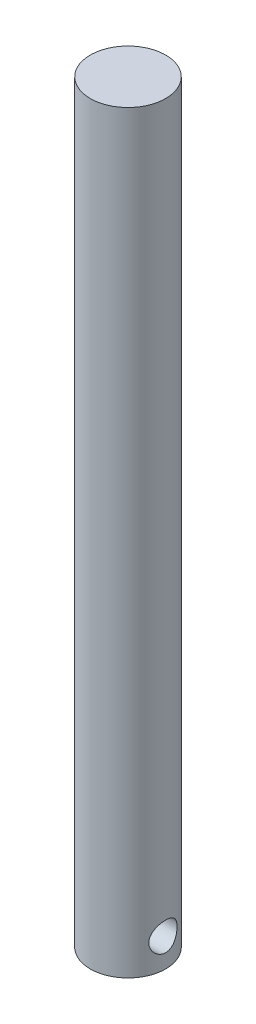
ISO-10303-21;
HEADER;
FILE_DESCRIPTION(('STEP AP214'),'2;1');
FILE_NAME('part.step','',(''),(''),'','','');
FILE_SCHEMA(('AUTOMOTIVE_DESIGN { 1 0 10303 214 1 1 1 1 }'));
ENDSEC;
DATA;
#1=APPLICATION_CONTEXT('core data for automotive mechanical design processes');
#2=APPLICATION_PROTOCOL_DEFINITION('international standard','automotive_design',2000,#1);
#3=PRODUCT_CONTEXT('',#1,'mechanical');
#4=PRODUCT('Part','Part','',(#3));
#5=PRODUCT_RELATED_PRODUCT_CATEGORY('part','',(#4));
#6=PRODUCT_DEFINITION_FORMATION('','',#4);
#7=PRODUCT_DEFINITION_CONTEXT('part definition',#1,'design');
#8=PRODUCT_DEFINITION('design','',#6,#7);
#9=PRODUCT_DEFINITION_SHAPE('','',#8);
#10=(LENGTH_UNIT() NAMED_UNIT(*) SI_UNIT(.MILLI.,.METRE.));
#11=(NAMED_UNIT(*) PLANE_ANGLE_UNIT() SI_UNIT($,.RADIAN.));
#12=(NAMED_UNIT(*) SI_UNIT($,.STERADIAN.) SOLID_ANGLE_UNIT());
#13=UNCERTAINTY_MEASURE_WITH_UNIT(LENGTH_MEASURE(1.E-05),#10,'distance_accuracy_value','');
#14=(GEOMETRIC_REPRESENTATION_CONTEXT(3) GLOBAL_UNCERTAINTY_ASSIGNED_CONTEXT((#13)) GLOBAL_UNIT_ASSIGNED_CONTEXT((#10,
#11,#12)) REPRESENTATION_CONTEXT('',''));
#15=CARTESIAN_POINT('',(0.,0.,0.));
#16=DIRECTION('',(0.,0.,1.));
#17=DIRECTION('',(1.,0.,0.));
#18=AXIS2_PLACEMENT_3D('',#15,#16,#17);
#19=CARTESIAN_POINT('',(0.,400.,0.));
#20=DIRECTION('',(0.,-1.,0.));
#21=DIRECTION('',(0.,0.,-1.));
#22=AXIS2_PLACEMENT_3D('',#19,#20,#21);
#23=CYLINDRICAL_SURFACE('',#22,20.);
#24=CARTESIAN_POINT('',(-20.,7.5,0.));
#25=CARTESIAN_POINT('',(-20.0000006949911,7.49999905254471,-0.203070968021458));
#26=CARTESIAN_POINT('',(-19.9969005176281,7.50825382526075,-0.406128872036971));
#27=CARTESIAN_POINT('',(-19.9845861075051,7.54118522354036,-0.810722493053341));
#28=CARTESIAN_POINT('',(-19.9753719932571,7.5658615307906,-1.01225823948296));
#29=CARTESIAN_POINT('',(-19.9510804699548,7.63138175661786,-1.41228165684715));
#30=CARTESIAN_POINT('',(-19.9360041221055,7.67222274902267,-1.61076987270177));
#31=CARTESIAN_POINT('',(-19.9003893947718,7.76967818443338,-2.00333465937662));
#32=CARTESIAN_POINT('',(-19.8798508703887,7.82629304588461,-2.19741111301496));
#33=CARTESIAN_POINT('',(-19.8338980424643,7.95464043265563,-2.57942334484994));
#34=CARTESIAN_POINT('',(-19.8084943914583,8.02633996223328,-2.76737150814739));
#35=CARTESIAN_POINT('',(-19.7534187407954,8.18435364903087,-3.13644330297231));
#36=CARTESIAN_POINT('',(-19.7237452567773,8.27067289049066,-3.31756453344304));
#37=CARTESIAN_POINT('',(-19.6608785037209,8.45722898093484,-3.67181392735243));
#38=CARTESIAN_POINT('',(-19.6276857148228,8.55746393196907,-3.84494317652612));
#39=CARTESIAN_POINT('',(-19.5585744043947,8.77119114612923,-4.18232397222971));
#40=CARTESIAN_POINT('',(-19.5226549005367,8.88468819508363,-4.34657228246888));
#41=CARTESIAN_POINT('',(-19.4475600773382,9.12874957328976,-4.67132012701298));
#42=CARTESIAN_POINT('',(-19.4083128458309,9.25979952141155,-4.83143819793329));
#43=CARTESIAN_POINT('',(-19.328838303106,9.53453766314849,-5.14017756215578));
#44=CARTESIAN_POINT('',(-19.2886109633058,9.6782262256576,-5.28879851964384));
#45=CARTESIAN_POINT('',(-19.2082062022255,9.97745495362616,-5.57375496212915));
#46=CARTESIAN_POINT('',(-19.1680288125827,10.1330005623441,-5.71008474111935));
#47=CARTESIAN_POINT('',(-19.0888249186339,10.4549402891235,-5.96951895886719));
#48=CARTESIAN_POINT('',(-19.0497980301105,10.6213307244897,-6.09262784997175));
#49=CARTESIAN_POINT('',(-18.9724859555749,10.9706897102901,-6.32936647954693));
#50=CARTESIAN_POINT('',(-18.9342875038848,11.1540502172022,-6.44244711735878));
#51=CARTESIAN_POINT('',(-18.8614640429767,11.5302929428809,-6.65263459332164));
#52=CARTESIAN_POINT('',(-18.826837602539,11.723171301916,-6.74974783856142));
#53=CARTESIAN_POINT('',(-18.7622651010258,12.1172311413085,-6.92721666163354));
#54=CARTESIAN_POINT('',(-18.732318593607,12.3184118275246,-7.00757383780173));
#55=CARTESIAN_POINT('',(-18.6781264228347,12.7276608085247,-7.15076659014489));
#56=CARTESIAN_POINT('',(-18.6538804250933,12.9357286984929,-7.21360319410448));
#57=CARTESIAN_POINT('',(-18.6128171932609,13.3485176391735,-7.3188864092305));
#58=CARTESIAN_POINT('',(-18.5957361566855,13.5530261968285,-7.36206332770832));
#59=CARTESIAN_POINT('',(-18.5682025890409,13.9653728897456,-7.43123437452077));
#60=CARTESIAN_POINT('',(-18.5577498877569,14.1732109393663,-7.4572289440963));
#61=CARTESIAN_POINT('',(-18.5438461337811,14.5904932418232,-7.49173666070089));
#62=CARTESIAN_POINT('',(-18.5403925915472,14.7999368969419,-7.50025602352703));
#63=CARTESIAN_POINT('',(-18.5406045750876,15.2187944656479,-7.49973228101478));
#64=CARTESIAN_POINT('',(-18.5442698247326,15.4282083800738,-7.49068985687681));
#65=CARTESIAN_POINT('',(-18.5581541826773,15.8327523463325,-7.45622070727225));
#66=CARTESIAN_POINT('',(-18.5679659887167,16.0279841783787,-7.43181178035891));
#67=CARTESIAN_POINT('',(-18.5934550735589,16.4156228607983,-7.36780931755873));
#68=CARTESIAN_POINT('',(-18.6091343980122,16.608028701577,-7.32821048574541));
#69=CARTESIAN_POINT('',(-18.6458755071589,16.9886034776448,-7.23421503229474));
#70=CARTESIAN_POINT('',(-18.6669358543613,17.176773529901,-7.17982236244593));
#71=CARTESIAN_POINT('',(-18.7138316388318,17.5478194033523,-7.05668780060369));
#72=CARTESIAN_POINT('',(-18.7396689024681,17.730693168571,-6.98794041903922));
#73=CARTESIAN_POINT('',(-18.7959041471208,18.0933307976233,-6.83525595221402));
#74=CARTESIAN_POINT('',(-18.8263777414694,18.2729743125707,-6.75106109551286));
#75=CARTESIAN_POINT('',(-18.8906847573172,18.6246197275464,-6.56896880176203));
#76=CARTESIAN_POINT('',(-18.9245193195636,18.7966190041746,-6.47106670768666));
#77=CARTESIAN_POINT('',(-18.9946467838013,19.1320100053651,-6.26222988156311));
#78=CARTESIAN_POINT('',(-19.0309399609969,19.295400762685,-6.1512936895239));
#79=CARTESIAN_POINT('',(-19.1050600058862,19.6127131494869,-5.91707432475699));
#80=CARTESIAN_POINT('',(-19.1428869428418,19.7666343505488,-5.79379059406597));
#81=CARTESIAN_POINT('',(-19.2217192251952,20.0742548826265,-5.52685758549759));
#82=CARTESIAN_POINT('',(-19.2627668694648,20.2272390814045,-5.38239554850842));
#83=CARTESIAN_POINT('',(-19.3444196466276,20.5205444429057,-5.08111960259879));
#84=CARTESIAN_POINT('',(-19.3850249099682,20.6608694325439,-4.9243094535767));
#85=CARTESIAN_POINT('',(-19.4647378562275,20.9280937220137,-4.59913178437367));
#86=CARTESIAN_POINT('',(-19.5038447299098,21.0549858305757,-4.4307581524274));
#87=CARTESIAN_POINT('',(-19.5794735643872,21.2943367780478,-4.08359626326275));
#88=CARTESIAN_POINT('',(-19.6159965527517,21.4068013691849,-3.90481219826151));
#89=CARTESIAN_POINT('',(-19.6860423205742,21.6181847048906,-3.53492899562549));
#90=CARTESIAN_POINT('',(-19.7195078794209,21.7168584703996,-3.34367879554688));
#91=CARTESIAN_POINT('',(-19.7818042347176,21.8976065846665,-2.95285527289817));
#92=CARTESIAN_POINT('',(-19.8106369862409,21.9796879393182,-2.75328550625454));
#93=CARTESIAN_POINT('',(-19.8628434264484,22.1265180706344,-2.34719996217688));
#94=CARTESIAN_POINT('',(-19.8862178749036,22.1912692597627,-2.14068515604437));
#95=CARTESIAN_POINT('',(-19.9268153054777,22.3027850737005,-1.72226565642152));
#96=CARTESIAN_POINT('',(-19.9440386557731,22.3495507750518,-1.5103612863393));
#97=CARTESIAN_POINT('',(-19.9710730258303,22.4225900452183,-1.09424775972726));
#98=CARTESIAN_POINT('',(-19.9812295417902,22.4498211771227,-0.890228709079149));
#99=CARTESIAN_POINT('',(-19.9952797490968,22.487424053648,-0.480429861153433));
#100=CARTESIAN_POINT('',(-19.9991736625905,22.4977963962844,-0.274650126591161));
#101=CARTESIAN_POINT('',(-20.0005896492051,22.501572423763,0.137045616648892));
#102=CARTESIAN_POINT('',(-19.9981129628774,22.4949794122809,0.342961590989929));
#103=CARTESIAN_POINT('',(-19.9868596574388,22.4649014511288,0.753379848819876));
#104=CARTESIAN_POINT('',(-19.9780831342252,22.4414167585874,0.957882153780112));
#105=CARTESIAN_POINT('',(-19.9549324504254,22.3790331468373,1.35605980169529));
#106=CARTESIAN_POINT('',(-19.9407879695859,22.3407656747715,1.54984794134557));
#107=CARTESIAN_POINT('',(-19.9072569807347,22.2491858797098,1.93344269290831));
#108=CARTESIAN_POINT('',(-19.887868626756,22.1958682584174,2.12324787732371));
#109=CARTESIAN_POINT('',(-19.8443406080703,22.0746766038757,2.49752579570186));
#110=CARTESIAN_POINT('',(-19.8202022917965,22.0068067012819,2.68200002602577));
#111=CARTESIAN_POINT('',(-19.7677484774414,21.8570256010086,3.04461799000738));
#112=CARTESIAN_POINT('',(-19.7394313942141,21.7751090730554,3.22275928941149));
#113=CARTESIAN_POINT('',(-19.6784277420874,21.5952919933077,3.57668241852781));
#114=CARTESIAN_POINT('',(-19.6456382523032,21.4969967123145,3.75224591151486));
#115=CARTESIAN_POINT('',(-19.5771555886676,21.2868820687758,4.09456511700747));
#116=CARTESIAN_POINT('',(-19.5414614186652,21.1750580601418,4.26131777525405));
#117=CARTESIAN_POINT('',(-19.4680439258145,20.9386328397494,4.58506525872597));
#118=CARTESIAN_POINT('',(-19.4303203062301,20.814029757071,4.74205864972659));
#119=CARTESIAN_POINT('',(-19.3537631643409,20.552813720806,5.04542669379827));
#120=CARTESIAN_POINT('',(-19.3149296015203,20.4162003284339,5.19180095855238));
#121=CARTESIAN_POINT('',(-19.2348304666649,20.1234421885064,5.4813462403016));
#122=CARTESIAN_POINT('',(-19.1935550246388,19.9666232257584,5.6238337222247));
#123=CARTESIAN_POINT('',(-19.1119813103232,19.6414001876497,5.89510225689365));
#124=CARTESIAN_POINT('',(-19.071682729132,19.4729998409202,6.02388768732425));
#125=CARTESIAN_POINT('',(-18.9931802921809,19.1254765836214,6.26701151435385));
#126=CARTESIAN_POINT('',(-18.9549774947293,18.9463483495654,6.38134264929434));
#127=CARTESIAN_POINT('',(-18.881842233177,18.5786052802664,6.59459943128485));
#128=CARTESIAN_POINT('',(-18.8469083964192,18.3899944784229,6.6935315561577));
#129=CARTESIAN_POINT('',(-18.7812317544014,18.0035125318189,6.87566403749447));
#130=CARTESIAN_POINT('',(-18.7505091923228,17.8056024054855,6.95878910381581));
#131=CARTESIAN_POINT('',(-18.694480634226,17.4027815202422,7.10793535121495));
#132=CARTESIAN_POINT('',(-18.6691723687546,17.1978737363964,7.17396370099289));
#133=CARTESIAN_POINT('',(-18.6248465673625,16.7825594582109,7.28826820106416));
#134=CARTESIAN_POINT('',(-18.6058271216825,16.572154654162,7.33654974112424));
#135=CARTESIAN_POINT('',(-18.5747639414794,16.1474688125651,7.41484504718195));
#136=CARTESIAN_POINT('',(-18.5627197204411,15.9331880464369,7.44486008725788));
#137=CARTESIAN_POINT('',(-18.5465933049917,15.516399006473,7.48493863022116));
#138=CARTESIAN_POINT('',(-18.5420491539834,15.3140191987622,7.4961604056798));
#139=CARTESIAN_POINT('',(-18.5396138019941,14.9089775659615,7.5021819174978));
#140=CARTESIAN_POINT('',(-18.5417223790381,14.7063157505067,7.49698220177711));
#141=CARTESIAN_POINT('',(-18.5525209844085,14.3022758039112,7.4702189157973));
#142=CARTESIAN_POINT('',(-18.5612103739758,14.100897550096,7.44865693372293));
#143=CARTESIAN_POINT('',(-18.5848804234321,13.7009073892477,7.38940016534893));
#144=CARTESIAN_POINT('',(-18.5998610789405,13.5022954802885,7.35170539028268));
#145=CARTESIAN_POINT('',(-18.6350757989785,13.1153148504017,7.26196897505606));
#146=CARTESIAN_POINT('',(-18.655133955521,12.926819015639,7.21040468493112));
#147=CARTESIAN_POINT('',(-18.7001191111151,12.55489240608,7.09291899633679));
#148=CARTESIAN_POINT('',(-18.7250477129692,12.3714633214304,7.02699287074366));
#149=CARTESIAN_POINT('',(-18.7790659217203,12.0108379094896,6.8813305560967));
#150=CARTESIAN_POINT('',(-18.8081548517944,11.8336405742171,6.80159661292323));
#151=CARTESIAN_POINT('',(-18.8697152850299,11.4863969945344,6.62889488784757));
#152=CARTESIAN_POINT('',(-18.9021880991186,11.3163535576455,6.53592197197538));
#153=CARTESIAN_POINT('',(-19.0069536143875,10.8010729091877,6.2277137240126));
#154=CARTESIAN_POINT('',(-19.0836670851801,10.4694346800832,5.99071861556498));
#155=CARTESIAN_POINT('',(-19.2403301804045,9.84920350283914,5.46664728657927));
#156=CARTESIAN_POINT('',(-19.3202808271434,9.56062428976864,5.17955514905406));
#157=CARTESIAN_POINT('',(-19.438676663767,9.1579298192362,4.7080940863324));
#158=CARTESIAN_POINT('',(-19.4788882496359,9.02579433025875,4.53926103129733));
#159=CARTESIAN_POINT('',(-19.55686920485,8.776240263987,4.19055225393181));
#160=CARTESIAN_POINT('',(-19.5946394801554,8.65881621198339,4.01068067682134));
#161=CARTESIAN_POINT('',(-19.6667051020052,8.43951031488935,3.6409088062972));
#162=CARTESIAN_POINT('',(-19.7009985836445,8.33763679623718,3.45100321297442));
#163=CARTESIAN_POINT('',(-19.7651027001156,8.15039996600227,3.06258638682355));
#164=CARTESIAN_POINT('',(-19.7949152332913,8.06502965845988,2.86407884437145));
#165=CARTESIAN_POINT('',(-19.8503942615567,7.90818968864652,2.45094825989373));
#166=CARTESIAN_POINT('',(-19.8758228421911,7.83748988226127,2.23600002200006));
#167=CARTESIAN_POINT('',(-19.9200461241093,7.71567009013676,1.79994016793749));
#168=CARTESIAN_POINT('',(-19.9388404924467,7.66455108707419,1.57882824303678));
#169=CARTESIAN_POINT('',(-19.969163307367,7.58252489103568,1.13248745661206));
#170=CARTESIAN_POINT('',(-19.9806948101893,7.55160919623015,0.907260367875009));
#171=CARTESIAN_POINT('',(-19.9961123363293,7.51034844111116,0.454683233786637));
#172=CARTESIAN_POINT('',(-19.9999992219729,7.50000106065512,0.227333430788376));
#173=CARTESIAN_POINT('',(-20.,7.5,0.));
#174=B_SPLINE_CURVE_WITH_KNOTS('',3,(#24,#25,#26,#27,#28,#29,#30,#31,#32,#33,#34,#35,#36,#37,
#38,#39,#40,#41,#42,#43,#44,#45,#46,#47,#48,#49,#50,#51,#52,#53,#54,#55,#56,#57,#58,#59,#60,#61,
#62,#63,#64,#65,#66,#67,#68,#69,#70,#71,#72,#73,#74,#75,#76,#77,#78,#79,#80,#81,#82,#83,#84,#85,
#86,#87,#88,#89,#90,#91,#92,#93,#94,#95,#96,#97,#98,#99,#100,#101,#102,#103,#104,#105,#106,#107,
#108,#109,#110,#111,#112,#113,#114,#115,#116,#117,#118,#119,#120,#121,#122,#123,#124,#125,#126,
#127,#128,#129,#130,#131,#132,#133,#134,#135,#136,#137,#138,#139,#140,#141,#142,#143,#144,#145,
#146,#147,#148,#149,#150,#151,#152,#153,#154,#155,#156,#157,#158,#159,#160,#161,#162,#163,#164,
#165,#166,#167,#168,#169,#170,#171,#172,#173),.UNSPECIFIED.,.T.,.F.,(4,2,2,2,2,2,2,2,2,2,2,2,2,
2,2,2,2,2,2,2,2,2,2,2,2,2,2,2,2,2,2,2,2,2,2,2,2,2,2,2,2,2,2,2,2,2,2,2,2,2,2,2,2,2,2,2,2,2,2,2,2,
2,2,2,2,2,2,2,2,2,2,2,2,2,4),(0.,0.608999956569121,1.2179881086895,1.82686607061669,
2.43576018624771,3.04333602101901,3.65112358554748,4.25882833580728,4.86675306673733,
5.49784759802492,6.12896055572049,6.76036500614003,7.39155614970224,8.04710389078631,
8.70238794089191,9.35760945582952,10.0127925263413,10.6411154155012,11.2694221687695,
11.8975053993619,12.5255642678541,13.1158609555577,13.706363636216,14.2967087341194,
14.8872800083734,15.48879042923,16.0905057110534,16.6922884573043,17.2940984093271,
17.9364976383173,18.5787020128302,19.2212484699716,19.8635379434159,20.5160836111604,
21.1683531732239,21.8205318881423,22.4726715600923,23.0901283371345,23.7075632112555,
24.3248778609402,24.9421831139336,25.5356078324119,26.129241722893,26.7227073333315,
27.3163986465876,27.9273114640636,28.5384346823473,29.149647500183,29.760882657408,
30.407730978247,31.0543720122049,31.7013366304338,32.3480283535228,32.9977271255338,
33.647153034297,34.2963815469097,34.9455647710004,35.5530262644448,36.1604674895258,
36.7678497615569,37.375231610664,37.96391674576,38.5527959370655,39.1415794353244,
39.7305918841889,40.9691711455771,42.2081446512167,42.8618687687023,43.5153488822951,
44.169177679639,44.8227286983722,45.5048205241399,46.186946576693,46.8687853960765,
47.5505472984583),.UNSPECIFIED.);
#175=CARTESIAN_POINT('',(-20.,7.5,0.));
#176=VERTEX_POINT('',#175);
#177=EDGE_CURVE('E10',#176,#176,#174,.T.);
#178=ORIENTED_EDGE('',*,*,#177,.T.);
#179=EDGE_LOOP('',(#178));
#180=FACE_BOUND('',#179,.T.);
#181=CARTESIAN_POINT('',(18.5404962177392,15.,-7.5));
#182=CARTESIAN_POINT('',(18.5404953224097,14.7974978060096,-7.5000009869232));
#183=CARTESIAN_POINT('',(18.5438227372952,14.5950089041121,-7.49179198278267));
#184=CARTESIAN_POINT('',(18.5570181171128,14.1915694542216,-7.45904772339184));
#185=CARTESIAN_POINT('',(18.5668859812118,13.9906188825607,-7.43451271983677));
#186=CARTESIAN_POINT('',(18.5928347283763,13.5917700624324,-7.36937720093294));
#187=CARTESIAN_POINT('',(18.6089151154898,13.3938715716255,-7.32877796800143));
#188=CARTESIAN_POINT('',(18.6467706011557,13.0025027243341,-7.23191850522156));
#189=CARTESIAN_POINT('',(18.6685458673708,12.8090324984045,-7.17565781428186));
#190=CARTESIAN_POINT('',(18.7170510739772,12.4283149986633,-7.04816520915828));
#191=CARTESIAN_POINT('',(18.7437677712502,12.2410526333694,-6.97697324428781));
#192=CARTESIAN_POINT('',(18.8014159881055,11.8733018175851,-6.82009805644918));
#193=CARTESIAN_POINT('',(18.8323489791812,11.6928157602108,-6.7344097717124));
#194=CARTESIAN_POINT('',(18.8975500805192,11.3397397292547,-6.54921612611515));
#195=CARTESIAN_POINT('',(18.9318178290444,11.1671489022188,-6.44971226339737));
#196=CARTESIAN_POINT('',(19.0027856809007,10.8307174158877,-6.23751976507693));
#197=CARTESIAN_POINT('',(19.0394866620283,10.6668799533124,-6.12482635996015));
#198=CARTESIAN_POINT('',(19.1160552293978,10.3417116049609,-5.88161583051215));
#199=CARTESIAN_POINT('',(19.1559909879852,10.1808259614593,-5.75052454250341));
#200=CARTESIAN_POINT('',(19.236396625561,9.87053460059045,-5.47554214773982));
#201=CARTESIAN_POINT('',(19.2768665178569,9.72112916987544,-5.33165072156859));
#202=CARTESIAN_POINT('',(19.3572864218219,9.43462012452277,-5.03185383236043));
#203=CARTESIAN_POINT('',(19.3972362278628,9.2975212564126,-4.8759437765764));
#204=CARTESIAN_POINT('',(19.4755430694438,9.03658956634239,-4.55310865244202));
#205=CARTESIAN_POINT('',(19.5139006530028,8.91275215641321,-4.38618742605285));
#206=CARTESIAN_POINT('',(19.5893188034776,8.67508498616598,-4.03629821702061));
#207=CARTESIAN_POINT('',(19.6262888750131,8.56174832561263,-3.85297519236613));
#208=CARTESIAN_POINT('',(19.6964131700799,8.35104814863502,-3.47676585930335));
#209=CARTESIAN_POINT('',(19.7295689239123,8.25367821965373,-3.28388343087266));
#210=CARTESIAN_POINT('',(19.7911292866315,8.07571144277501,-2.88980371739804));
#211=CARTESIAN_POINT('',(19.8195341465378,7.99511370864179,-2.68860687235808));
#212=CARTESIAN_POINT('',(19.870758846536,7.85146416540895,-2.27935469406785));
#213=CARTESIAN_POINT('',(19.8935789958647,7.78841138478243,-2.0712997412894));
#214=CARTESIAN_POINT('',(19.9321000198196,7.68283388864295,-1.65903185753338));
#215=CARTESIAN_POINT('',(19.9480654825133,7.63954113595846,-1.45504019875767));
#216=CARTESIAN_POINT('',(19.9738071217704,7.5700595377062,-1.04377707503387));
#217=CARTESIAN_POINT('',(19.9835834607934,7.54387024318573,-0.836505696322226));
#218=CARTESIAN_POINT('',(19.9966654412576,7.50887909782407,-0.420354574774007));
#219=CARTESIAN_POINT('',(19.9999728807609,7.50007241539497,-0.211475295071757));
#220=CARTESIAN_POINT('',(20.0000267827777,7.49992848183823,0.206287115248226));
#221=CARTESIAN_POINT('',(19.9967734436821,7.50859070246968,0.415170245558521));
#222=CARTESIAN_POINT('',(19.9841241822876,7.54242350457666,0.82092478438885));
#223=CARTESIAN_POINT('',(19.9750417982919,7.56675164414675,1.01787692294658));
#224=CARTESIAN_POINT('',(19.9512702079543,7.63087049214382,1.40897486157292));
#225=CARTESIAN_POINT('',(19.936579032245,7.67066663180728,1.60311965104185));
#226=CARTESIAN_POINT('',(19.901970083881,7.76533681279645,1.98714556746211));
#227=CARTESIAN_POINT('',(19.8820540701359,7.82020578024,2.17702810596543));
#228=CARTESIAN_POINT('',(19.8374822392236,7.94457154398471,2.55144261703941));
#229=CARTESIAN_POINT('',(19.8128246262127,8.01407388351051,2.73597253177391));
#230=CARTESIAN_POINT('',(19.7589981323454,8.16821438768836,3.10105157048046));
#231=CARTESIAN_POINT('',(19.7297703213454,8.25305292129992,3.28150734025972));
#232=CARTESIAN_POINT('',(19.6677722023859,8.43656177595608,3.63467969444453));
#233=CARTESIAN_POINT('',(19.6350006876899,8.53523681215794,3.80739361401921));
#234=CARTESIAN_POINT('',(19.5667108585588,8.74571494720971,4.14407240516367));
#235=CARTESIAN_POINT('',(19.5311923041765,8.85751919330747,4.30803651033958));
#236=CARTESIAN_POINT('',(19.4582558645941,9.09353610170818,4.62633148614566));
#237=CARTESIAN_POINT('',(19.4208378914465,9.21774933883418,4.78066190997518));
#238=CARTESIAN_POINT('',(19.3427614579063,9.48549503871858,5.08764327025446));
#239=CARTESIAN_POINT('',(19.3020417388076,9.62973365119048,5.23966337967101));
#240=CARTESIAN_POINT('',(19.2205694129846,9.93036357364366,5.53105758262263));
#241=CARTESIAN_POINT('',(19.1798168198261,10.0867512174097,5.67043546389653));
#242=CARTESIAN_POINT('',(19.099349763852,10.4109020024394,5.93583033027933));
#243=CARTESIAN_POINT('',(19.0596359570341,10.5786721024104,6.06183901918788));
#244=CARTESIAN_POINT('',(18.9824037565471,10.9244587344019,6.29952071308181));
#245=CARTESIAN_POINT('',(18.9448845116693,11.1024712398199,6.41119929664526));
#246=CARTESIAN_POINT('',(18.8723059405916,11.4719035500239,6.62183998263337));
#247=CARTESIAN_POINT('',(18.8373218510503,11.6635360532493,6.72045560402777));
#248=CARTESIAN_POINT('',(18.7719180789529,12.0551481514442,6.90103740851105));
#249=CARTESIAN_POINT('',(18.7414964545185,12.2551241486632,6.98301068020891));
#250=CARTESIAN_POINT('',(18.6862349535935,12.6620539614135,7.12956958135856));
#251=CARTESIAN_POINT('',(18.6613937801315,12.8690061427007,7.19415925168389));
#252=CARTESIAN_POINT('',(18.6181696387706,13.2883582121728,7.30529423112176));
#253=CARTESIAN_POINT('',(18.599786227337,13.5007577251461,7.35184077950219));
#254=CARTESIAN_POINT('',(18.5709753237017,13.9174497555547,7.42430523075386));
#255=CARTESIAN_POINT('',(18.560164779084,14.1215428464128,7.45121974602804));
#256=CARTESIAN_POINT('',(18.5452837262722,14.5314943549129,7.48818088516806));
#257=CARTESIAN_POINT('',(18.5412129694137,14.7373527071438,7.49822813135196));
#258=CARTESIAN_POINT('',(18.5399530934917,15.1491722484598,7.50134264302441));
#259=CARTESIAN_POINT('',(18.5427624610903,15.3551334049692,7.49441364257287));
#260=CARTESIAN_POINT('',(18.5551620148917,15.7655808400759,7.46366108584836));
#261=CARTESIAN_POINT('',(18.5647520694556,15.9700671472278,7.43983785755629));
#262=CARTESIAN_POINT('',(18.5897695457317,16.3662907898847,7.37709594127097));
#263=CARTESIAN_POINT('',(18.604896368617,16.5581706486087,7.33895237638272));
#264=CARTESIAN_POINT('',(18.6405452068705,16.9379583751764,7.24792809387929));
#265=CARTESIAN_POINT('',(18.6610691077265,17.1258648300626,7.19504222560108));
#266=CARTESIAN_POINT('',(18.7069046762843,17.4964143394284,7.07501507210817));
#267=CARTESIAN_POINT('',(18.7322153017317,17.679058529748,7.00787688978219));
#268=CARTESIAN_POINT('',(18.7869291358806,18.0381260340949,6.85984825426257));
#269=CARTESIAN_POINT('',(18.8163339081421,18.214546939026,6.77895254442523));
#270=CARTESIAN_POINT('',(18.8795973458532,18.5665498125484,6.60076264292971));
#271=CARTESIAN_POINT('',(18.9135808067264,18.7418576512,6.50297128051826));
#272=CARTESIAN_POINT('',(18.9841787633217,19.083752895901,6.29389628822991));
#273=CARTESIAN_POINT('',(19.0207941611726,19.2503372777337,6.18260802305396));
#274=CARTESIAN_POINT('',(19.0956911453941,19.5738596901049,5.94725380112183));
#275=CARTESIAN_POINT('',(19.1339729797655,19.7307962764068,5.82318593871227));
#276=CARTESIAN_POINT('',(19.2112294602068,20.034169169549,5.56300964363641));
#277=CARTESIAN_POINT('',(19.2502041288368,20.1806051336838,5.42690081831649));
#278=CARTESIAN_POINT('',(19.3303595557125,20.4711538231593,5.13435821741344));
#279=CARTESIAN_POINT('',(19.3715227990074,20.6145251593872,4.97718214295383));
#280=CARTESIAN_POINT('',(19.4524007433728,20.8875198423447,4.65105553495338));
#281=CARTESIAN_POINT('',(19.4921159105895,21.0171476393173,4.48210884235636));
#282=CARTESIAN_POINT('',(19.5690423284403,21.2618622140712,4.13333757831281));
#283=CARTESIAN_POINT('',(19.6062525124191,21.376942815542,3.95350843409318));
#284=CARTESIAN_POINT('',(19.6771076282834,21.5915722861126,3.58423765267745));
#285=CARTESIAN_POINT('',(19.7107540796951,21.6911277835248,3.39480016371675));
#286=CARTESIAN_POINT('',(19.7734617330869,21.873653762698,3.00806654020194));
#287=CARTESIAN_POINT('',(19.8025363265057,21.9566728792304,2.81079556038407));
#288=CARTESIAN_POINT('',(19.8553800630768,22.1057000485577,2.40932586067651));
#289=CARTESIAN_POINT('',(19.8791513910047,22.1717151082189,2.20513003369066));
#290=CARTESIAN_POINT('',(19.9207053383391,22.286106152905,1.79129391656522));
#291=CARTESIAN_POINT('',(19.9384890302562,22.334485297019,1.5816546087206));
#292=CARTESIAN_POINT('',(19.9675409586902,22.4130985551951,1.15855898199488));
#293=CARTESIAN_POINT('',(19.9788095699415,22.4433337128664,0.945102883376095));
#294=CARTESIAN_POINT('',(19.994033691942,22.4840974254402,0.52865316639119));
#295=CARTESIAN_POINT('',(19.9983774290369,22.4956725768918,0.325775516304368));
#296=CARTESIAN_POINT('',(20.0008692504359,22.5023184527493,-0.0802860561737167));
#297=CARTESIAN_POINT('',(19.9990175172038,22.4973896632156,-0.283469969369015));
#298=CARTESIAN_POINT('',(19.9891694232853,22.4710803582997,-0.688592382265942));
#299=CARTESIAN_POINT('',(19.9811737992118,22.4497018151362,-0.89053102834156));
#300=CARTESIAN_POINT('',(19.9592554861488,22.3907123131437,-1.29169455604582));
#301=CARTESIAN_POINT('',(19.9453328012982,22.3531013656495,-1.49091943956936));
#302=CARTESIAN_POINT('',(19.9123447500905,22.2631382694998,-1.88036572453599));
#303=CARTESIAN_POINT('',(19.8934145529797,22.2111721807536,-2.07068801635589));
#304=CARTESIAN_POINT('',(19.8507365710876,22.0925877644872,-2.44621927037351));
#305=CARTESIAN_POINT('',(19.8269871880602,22.0259645754341,-2.63142651299356));
#306=CARTESIAN_POINT('',(19.7752570431207,21.8786299218452,-2.99549554755507));
#307=CARTESIAN_POINT('',(19.7472772125743,21.7979215576678,-3.17435872551703));
#308=CARTESIAN_POINT('',(19.6877525574342,21.6230162987584,-3.52477756890161));
#309=CARTESIAN_POINT('',(19.6562063563736,21.5288141922459,-3.6963303774175));
#310=CARTESIAN_POINT('',(19.554561135393,21.2185406014367,-4.21249085383753));
#311=CARTESIAN_POINT('',(19.4796804913368,20.9808928588639,-4.54349867948237));
#312=CARTESIAN_POINT('',(19.324956892237,20.4558847604311,-5.16217583421437));
#313=CARTESIAN_POINT('',(19.2451121724607,20.1685066598906,-5.4498296250265));
#314=CARTESIAN_POINT('',(19.1256056130632,19.6971865773472,-5.85082175343824));
#315=CARTESIAN_POINT('',(19.0848023282747,19.528621167207,-5.98225071653415));
#316=CARTESIAN_POINT('',(19.0052281280351,19.1805935034642,-6.23043039180563));
#317=CARTESIAN_POINT('',(18.9664564672199,19.0011352991193,-6.34718650946531));
#318=CARTESIAN_POINT('',(18.8920869635042,18.6322984404593,-6.56523732847428));
#319=CARTESIAN_POINT('',(18.8564909084149,18.4429142920629,-6.66652334298533));
#320=CARTESIAN_POINT('',(18.7896345988493,18.0556059793034,-6.85269387903114));
#321=CARTESIAN_POINT('',(18.7583724989936,17.8576854970329,-6.93758538736538));
#322=CARTESIAN_POINT('',(18.6999432186437,17.4456617929,-7.09361547855015));
#323=CARTESIAN_POINT('',(18.6730182373562,17.2312299840678,-7.16397993519202));
#324=CARTESIAN_POINT('',(18.6260433721863,16.7961757500304,-7.28524160275741));
#325=CARTESIAN_POINT('',(18.605993797622,16.5755530467855,-7.33613793784014));
#326=CARTESIAN_POINT('',(18.5735837707709,16.1301794212019,-7.41781108706266));
#327=CARTESIAN_POINT('',(18.5612190140678,15.90543088259,-7.44859916472204));
#328=CARTESIAN_POINT('',(18.5446762186845,15.4537824973921,-7.48969186841523));
#329=CARTESIAN_POINT('',(18.5404972208638,15.22688290598,-7.49999889425394));
#330=CARTESIAN_POINT('',(18.5404962177392,15.,-7.5));
#331=B_SPLINE_CURVE_WITH_KNOTS('',3,(#181,#182,#183,#184,#185,#186,#187,#188,#189,#190,#191,
#192,#193,#194,#195,#196,#197,#198,#199,#200,#201,#202,#203,#204,#205,#206,#207,#208,#209,#210,
#211,#212,#213,#214,#215,#216,#217,#218,#219,#220,#221,#222,#223,#224,#225,#226,#227,#228,#229,
#230,#231,#232,#233,#234,#235,#236,#237,#238,#239,#240,#241,#242,#243,#244,#245,#246,#247,#248,
#249,#250,#251,#252,#253,#254,#255,#256,#257,#258,#259,#260,#261,#262,#263,#264,#265,#266,#267,
#268,#269,#270,#271,#272,#273,#274,#275,#276,#277,#278,#279,#280,#281,#282,#283,#284,#285,#286,
#287,#288,#289,#290,#291,#292,#293,#294,#295,#296,#297,#298,#299,#300,#301,#302,#303,#304,#305,
#306,#307,#308,#309,#310,#311,#312,#313,#314,#315,#316,#317,#318,#319,#320,#321,#322,#323,#324,
#325,#326,#327,#328,#329,#330),.UNSPECIFIED.,.T.,.F.,(4,2,2,2,2,2,2,2,2,2,2,2,2,2,2,2,2,2,2,2,2,
2,2,2,2,2,2,2,2,2,2,2,2,2,2,2,2,2,2,2,2,2,2,2,2,2,2,2,2,2,2,2,2,2,2,2,2,2,2,2,2,2,2,2,2,2,2,2,2,
2,2,2,2,2,4),(0.,0.607291188521899,1.2145730147521,1.82180637108003,2.42905760694764,
3.03470438034214,3.64056306926775,4.24635611092872,4.85236889621784,5.48567597494483,
6.11899886173822,6.75256497509163,7.38591118524912,8.04112280265406,8.69607062610361,
9.35098383359047,10.0058607689675,10.6324949318571,11.2591126454177,11.8855561627681,
12.5119807374218,13.1072510967977,13.7027306609196,14.2980100171854,14.893515276492,
15.4974520438402,16.1015951211854,16.7057910286949,17.3100149374271,17.949721019084,
18.5892348008609,19.229143137491,19.868801603013,20.5229900265601,21.1768992190955,
21.8306562768132,22.4843684241355,23.102006617583,23.7196220227626,24.3371015907389,
24.9545691714283,25.5425528011604,26.1307421185287,26.7188035115704,27.3070901051867,
27.9172096437158,28.5275393147449,29.1379601283326,29.7484008549758,30.3977035771158,
31.0467954047361,31.6961618985608,32.3452503872899,32.9924007152125,33.6392839435614,
34.2860512398967,34.932781331783,35.5417883699399,36.1507774722873,36.7596935721676,
37.3686092468476,37.9625211661721,38.5566303746719,39.1506089753782,39.7448176142173,
40.9819726224251,42.219569983324,42.871732058979,43.5236531690476,44.1759390133594,
44.8279462584768,45.5087844750643,46.1896533179126,46.8701404483301,47.5505478400367),.UNSPECIFIED.);
#332=CARTESIAN_POINT('',(18.5404962177392,15.,-7.5));
#333=VERTEX_POINT('',#332);
#334=EDGE_CURVE('E49',#333,#333,#331,.T.);
#335=ORIENTED_EDGE('',*,*,#334,.T.);
#336=EDGE_LOOP('',(#335));
#337=FACE_BOUND('',#336,.T.);
#338=CARTESIAN_POINT('',(0.,400.,0.));
#339=DIRECTION('',(0.,1.,0.));
#340=DIRECTION('',(0.,0.,1.));
#341=AXIS2_PLACEMENT_3D('',#338,#339,#340);
#342=CIRCLE('',#341,20.);
#343=CARTESIAN_POINT('',(0.,400.,20.));
#344=VERTEX_POINT('',#343);
#345=EDGE_CURVE('E54',#344,#344,#342,.T.);
#346=ORIENTED_EDGE('',*,*,#345,.F.);
#347=EDGE_LOOP('',(#346));
#348=FACE_BOUND('',#347,.T.);
#349=CARTESIAN_POINT('',(0.,0.,0.));
#350=DIRECTION('',(0.,1.,0.));
#351=DIRECTION('',(0.,0.,1.));
#352=AXIS2_PLACEMENT_3D('',#349,#350,#351);
#353=CIRCLE('',#352,20.);
#354=CARTESIAN_POINT('',(0.,0.,20.));
#355=VERTEX_POINT('',#354);
#356=EDGE_CURVE('E59',#355,#355,#353,.T.);
#357=ORIENTED_EDGE('',*,*,#356,.T.);
#358=EDGE_LOOP('',(#357));
#359=FACE_BOUND('',#358,.T.);
#360=ADVANCED_FACE('F37',(#180,#337,#348,#359),#23,.T.);
#361=CARTESIAN_POINT('',(0.,400.,0.));
#362=DIRECTION('',(0.,1.,0.));
#363=DIRECTION('',(0.,0.,1.));
#364=AXIS2_PLACEMENT_3D('',#361,#362,#363);
#365=PLANE('',#364);
#366=ORIENTED_EDGE('',*,*,#345,.T.);
#367=EDGE_LOOP('',(#366));
#368=FACE_BOUND('',#367,.T.);
#369=ADVANCED_FACE('F71',(#368),#365,.T.);
#370=CARTESIAN_POINT('',(0.,0.,0.));
#371=DIRECTION('',(0.,1.,0.));
#372=DIRECTION('',(0.,0.,1.));
#373=AXIS2_PLACEMENT_3D('',#370,#371,#372);
#374=PLANE('',#373);
#375=ORIENTED_EDGE('',*,*,#356,.F.);
#376=EDGE_LOOP('',(#375));
#377=FACE_BOUND('',#376,.T.);
#378=ADVANCED_FACE('F69',(#377),#374,.F.);
#379=CARTESIAN_POINT('',(-20.,15.,0.));
#380=DIRECTION('',(1.,0.,0.));
#381=DIRECTION('',(0.,0.,-1.));
#382=AXIS2_PLACEMENT_3D('',#379,#380,#381);
#383=CYLINDRICAL_SURFACE('',#382,7.5);
#384=ORIENTED_EDGE('',*,*,#334,.F.);
#385=EDGE_LOOP('',(#384));
#386=FACE_BOUND('',#385,.T.);
#387=ORIENTED_EDGE('',*,*,#177,.F.);
#388=EDGE_LOOP('',(#387));
#389=FACE_BOUND('',#388,.T.);
#390=ADVANCED_FACE('F65',(#386,#389),#383,.F.);
#391=CLOSED_SHELL('',(#360,#369,#378,#390));
#392=MANIFOLD_SOLID_BREP('B2',#391);
#393=ADVANCED_BREP_SHAPE_REPRESENTATION('',(#18,#392),#14);
#394=SHAPE_DEFINITION_REPRESENTATION(#9,#393);
ENDSEC;
END-ISO-10303-21;
